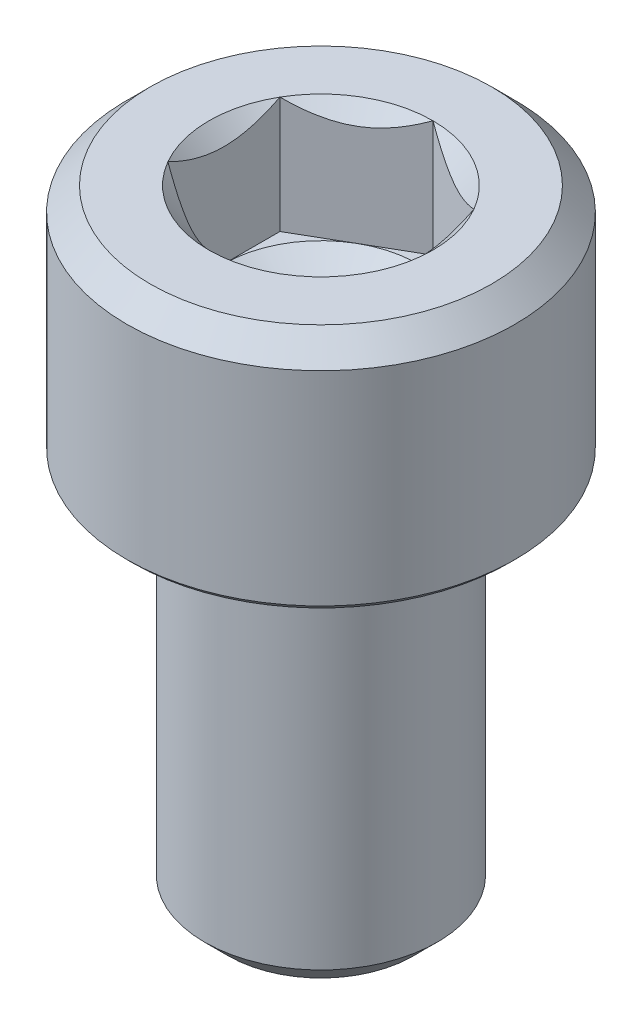
ISO-10303-21;
HEADER;
FILE_DESCRIPTION(('STEP AP214'),'2;1');
FILE_NAME('part.step','',(''),(''),'','','');
FILE_SCHEMA(('AUTOMOTIVE_DESIGN { 1 0 10303 214 1 1 1 1 }'));
ENDSEC;
DATA;
#1=APPLICATION_CONTEXT('core data for automotive mechanical design processes');
#2=APPLICATION_PROTOCOL_DEFINITION('international standard','automotive_design',2000,#1);
#3=PRODUCT_CONTEXT('',#1,'mechanical');
#4=PRODUCT('Part','Part','',(#3));
#5=PRODUCT_RELATED_PRODUCT_CATEGORY('part','',(#4));
#6=PRODUCT_DEFINITION_FORMATION('','',#4);
#7=PRODUCT_DEFINITION_CONTEXT('part definition',#1,'design');
#8=PRODUCT_DEFINITION('design','',#6,#7);
#9=PRODUCT_DEFINITION_SHAPE('','',#8);
#10=(LENGTH_UNIT() NAMED_UNIT(*) SI_UNIT(.MILLI.,.METRE.));
#11=(NAMED_UNIT(*) PLANE_ANGLE_UNIT() SI_UNIT($,.RADIAN.));
#12=(NAMED_UNIT(*) SI_UNIT($,.STERADIAN.) SOLID_ANGLE_UNIT());
#13=UNCERTAINTY_MEASURE_WITH_UNIT(LENGTH_MEASURE(1.E-05),#10,'distance_accuracy_value','');
#14=(GEOMETRIC_REPRESENTATION_CONTEXT(3) GLOBAL_UNCERTAINTY_ASSIGNED_CONTEXT((#13)) GLOBAL_UNIT_ASSIGNED_CONTEXT((#10,
#11,#12)) REPRESENTATION_CONTEXT('',''));
#15=CARTESIAN_POINT('',(0.,0.,0.));
#16=DIRECTION('',(0.,0.,1.));
#17=DIRECTION('',(1.,0.,0.));
#18=AXIS2_PLACEMENT_3D('',#15,#16,#17);
#19=CARTESIAN_POINT('',(0.,6.,0.));
#20=DIRECTION('',(0.,1.,0.));
#21=DIRECTION('',(0.,0.,1.));
#22=AXIS2_PLACEMENT_3D('',#19,#20,#21);
#23=CONICAL_SURFACE('',#22,2.8867513459481,0.785398163397449);
#24=CARTESIAN_POINT('',(0.,6.,0.));
#25=DIRECTION('',(0.,1.,0.));
#26=DIRECTION('',(0.,0.,1.));
#27=AXIS2_PLACEMENT_3D('',#24,#25,#26);
#28=CIRCLE('',#27,2.8867513459481);
#29=CARTESIAN_POINT('',(-2.5,6.,-1.4433756729741));
#30=VERTEX_POINT('',#29);
#31=CARTESIAN_POINT('',(-2.49999999999992,6.,1.44337567297415));
#32=VERTEX_POINT('',#31);
#33=EDGE_CURVE('E248',#30,#32,#28,.T.);
#34=ORIENTED_EDGE('',*,*,#33,.T.);
#35=CARTESIAN_POINT('',(-2.5,8.13577537813778,4.35611922405216));
#36=CARTESIAN_POINT('',(-2.5,8.02405641725018,4.22725866001411));
#37=CARTESIAN_POINT('',(-2.5,7.91298496215348,4.09782489086442));
#38=CARTESIAN_POINT('',(-2.5,7.69259879452268,3.83736651955328));
#39=CARTESIAN_POINT('',(-2.5,7.58328494304011,3.70634118973727));
#40=CARTESIAN_POINT('',(-2.5,7.36449428724609,3.43934006325917));
#41=CARTESIAN_POINT('',(-2.5,7.25507161834458,3.30331973073166));
#42=CARTESIAN_POINT('',(-2.5,7.03955046037823,3.02871290645587));
#43=CARTESIAN_POINT('',(-2.5,6.93345114490513,2.89012706652308));
#44=CARTESIAN_POINT('',(-2.5,6.72569625037672,2.60935358025565));
#45=CARTESIAN_POINT('',(-2.5,6.6240468245615,2.46716135079698));
#46=CARTESIAN_POINT('',(-2.5,6.42728703234702,2.17809364419258));
#47=CARTESIAN_POINT('',(-2.5,6.33218202887993,2.03121446717302));
#48=CARTESIAN_POINT('',(-2.5,6.15259291190783,1.73256542621068));
#49=CARTESIAN_POINT('',(-2.5,6.06803248336327,1.58084206421607));
#50=CARTESIAN_POINT('',(-2.5,5.91405163519296,1.26990866786594));
#51=CARTESIAN_POINT('',(-2.5,5.84460335921078,1.11071307737));
#52=CARTESIAN_POINT('',(-2.5,5.75713367176379,0.863830735911962));
#53=CARTESIAN_POINT('',(-2.5,5.73056031651566,0.77918822794078));
#54=CARTESIAN_POINT('',(-2.5,5.68477521230842,0.607910212253449));
#55=CARTESIAN_POINT('',(-2.5,5.66556228833098,0.521275024991145));
#56=CARTESIAN_POINT('',(-2.5,5.63577461402971,0.347055167302571));
#57=CARTESIAN_POINT('',(-2.5,5.62514725633831,0.259479663207441));
#58=CARTESIAN_POINT('',(-2.5,5.61311288672129,0.0836918904943487));
#59=CARTESIAN_POINT('',(-2.5,5.61170490624327,-0.00452031025991832));
#60=CARTESIAN_POINT('',(-2.5,5.61822212538,-0.180706628736106));
#61=CARTESIAN_POINT('',(-2.5,5.62615950537358,-0.268680285623321));
#62=CARTESIAN_POINT('',(-2.5,5.65078694752076,-0.4433847172262));
#63=CARTESIAN_POINT('',(-2.5,5.66747873326785,-0.53011524373493));
#64=CARTESIAN_POINT('',(-2.5,5.70866876791724,-0.702320390459004));
#65=CARTESIAN_POINT('',(-2.5,5.73322158395549,-0.787781727344903));
#66=CARTESIAN_POINT('',(-2.5,5.78880674634176,-0.956537282986467));
#67=CARTESIAN_POINT('',(-2.5,5.81983916442736,-1.03983147773758));
#68=CARTESIAN_POINT('',(-2.5,5.89474881513276,-1.22278399037513));
#69=CARTESIAN_POINT('',(-2.5,5.93994460001273,-1.32189786118762));
#70=CARTESIAN_POINT('',(-2.5,6.03636406758989,-1.51717428919826));
#71=CARTESIAN_POINT('',(-2.5,6.08759123298224,-1.61333510041087));
#72=CARTESIAN_POINT('',(-2.5,6.19473393742913,-1.80324961470382));
#73=CARTESIAN_POINT('',(-2.5,6.25065896885276,-1.89699791868208));
#74=CARTESIAN_POINT('',(-2.5,6.36602738775932,-2.0822628264869));
#75=CARTESIAN_POINT('',(-2.5,6.42547007579172,-2.17377986890127));
#76=CARTESIAN_POINT('',(-2.5,6.54742331755098,-2.35544305197522));
#77=CARTESIAN_POINT('',(-2.5,6.60994847288596,-2.44557934493647));
#78=CARTESIAN_POINT('',(-2.5,6.73719466368036,-2.62429215374481));
#79=CARTESIAN_POINT('',(-2.5,6.80191586463728,-2.71286855126818));
#80=CARTESIAN_POINT('',(-2.5,6.99853021283137,-2.97643633428369));
#81=CARTESIAN_POINT('',(-2.5,7.13302426311329,-3.14948514704153));
#82=CARTESIAN_POINT('',(-2.5,7.41100964091672,-3.49742558299302));
#83=CARTESIAN_POINT('',(-2.5,7.554651272507,-3.67219593456774));
#84=CARTESIAN_POINT('',(-2.5,7.77187642571592,-3.93128178305337));
#85=CARTESIAN_POINT('',(-2.5,7.84418027248007,-4.01667541105766));
#86=CARTESIAN_POINT('',(-2.5,7.98948272073259,-4.18683801333489));
#87=CARTESIAN_POINT('',(-2.5,8.06248116930567,-4.27160711812367));
#88=CARTESIAN_POINT('',(-2.5,8.13577537813778,-4.35611922405216));
#89=B_SPLINE_CURVE_WITH_KNOTS('',3,(#35,#36,#37,#38,#39,#40,#41,#42,#43,#44,#45,#46,#47,#48,#49,
#50,#51,#52,#53,#54,#55,#56,#57,#58,#59,#60,#61,#62,#63,#64,#65,#66,#67,#68,#69,#70,#71,#72,#73,
#74,#75,#76,#77,#78,#79,#80,#81,#82,#83,#84,#85,#86,#87,#88),.UNSPECIFIED.,.F.,.F.,(4,2,2,2,2,2,
2,2,2,2,2,2,2,2,2,2,2,2,2,2,2,2,2,2,2,2,4),(0.,0.511651260827456,1.02354597863304,
1.54722019644247,2.07076314295684,2.59500853626768,3.11967853721106,3.64029866615624,
4.15995084602471,4.42583268235065,4.69167205562896,4.95586989463535,5.22003997758482,
5.48455475102643,5.74912162248551,6.0155663133838,6.28201395432689,6.60853329817757,
6.93524211714078,7.26262772981258,7.58994846247603,7.91900556147608,8.24808751406486,
8.9054558787836,9.58407513821354,9.9197492883033,10.2553511756034),.UNSPECIFIED.);
#90=EDGE_CURVE('E135',#32,#30,#89,.T.);
#91=ORIENTED_EDGE('',*,*,#90,.T.);
#92=EDGE_LOOP('',(#34,#91));
#93=FACE_BOUND('',#92,.T.);
#94=ADVANCED_FACE('F43',(#93),#23,.F.);
#95=CARTESIAN_POINT('',(0.,6.,-2.8867513459481));
#96=VERTEX_POINT('',#95);
#97=EDGE_CURVE('E250',#96,#30,#28,.T.);
#98=ORIENTED_EDGE('',*,*,#97,.T.);
#99=CARTESIAN_POINT('',(-2.5002,6.00011547698181,-1.44326020292026));
#100=CARTESIAN_POINT('',(-2.41426172221223,5.95054070535477,-1.49287669073472));
#101=CARTESIAN_POINT('',(-2.32688643272424,5.90387748136255,-1.54332283764113));
#102=CARTESIAN_POINT('',(-2.1487185438344,5.81843814003834,-1.64618811625262));
#103=CARTESIAN_POINT('',(-2.05790899931891,5.77970956240604,-1.69861703122362));
#104=CARTESIAN_POINT('',(-1.87479587687306,5.71336670389778,-1.80433744175989));
#105=CARTESIAN_POINT('',(-1.78253893547064,5.68558566853089,-1.85760201171318));
#106=CARTESIAN_POINT('',(-1.59599399122369,5.6427831759107,-1.96530378549012));
#107=CARTESIAN_POINT('',(-1.50171168743369,5.62772976667138,-2.01973769896309));
#108=CARTESIAN_POINT('',(-1.33922174170812,5.61414772220951,-2.11355131286835));
#109=CARTESIAN_POINT('',(-1.27122403211982,5.61213709924083,-2.15280980880343));
#110=CARTESIAN_POINT('',(-1.13533975883075,5.61552411718752,-2.23126263056551));
#111=CARTESIAN_POINT('',(-1.06745324244773,5.62092435529985,-2.27045692907359));
#112=CARTESIAN_POINT('',(-0.932321211763859,5.6388257884025,-2.34847544336506));
#113=CARTESIAN_POINT('',(-0.865076500246403,5.65133492704651,-2.38729919566124));
#114=CARTESIAN_POINT('',(-0.731749899181763,5.68276750195574,-2.46427534467605));
#115=CARTESIAN_POINT('',(-0.665667920900304,5.70169044649685,-2.50242779262543));
#116=CARTESIAN_POINT('',(-0.496403653308703,5.75786736140827,-2.60015256308362));
#117=CARTESIAN_POINT('',(-0.394270877777082,5.79935583159621,-2.65911894852988));
#118=CARTESIAN_POINT('',(-0.244093585059476,5.8693940467231,-2.74582384890656));
#119=CARTESIAN_POINT('',(-0.194603460117378,5.89400225211609,-2.7743969858641));
#120=CARTESIAN_POINT('',(-0.0965399361611472,5.94546188671524,-2.83101398781791));
#121=CARTESIAN_POINT('',(-0.047965996503069,5.97231193877936,-2.85905816495511));
#122=CARTESIAN_POINT('',(0.00020000000000021,6.00011547698176,-2.88686681600194));
#123=B_SPLINE_CURVE_WITH_KNOTS('',3,(#99,#100,#101,#102,#103,#104,#105,#106,#107,#108,#109,#110,
#111,#112,#113,#114,#115,#116,#117,#118,#119,#120,#121,#122),.UNSPECIFIED.,.F.,.F.,(4,2,2,2,2,2,
2,2,2,2,2,4),(0.,0.33301208513393,0.667964518301409,0.997597032043318,1.32639954393847,
1.56169424147171,1.79707142102085,2.03271213522173,2.26833478775653,2.64260240809533,
2.82922877818862,3.01574133749021),.UNSPECIFIED.);
#124=EDGE_CURVE('E210',#30,#96,#123,.T.);
#125=ORIENTED_EDGE('',*,*,#124,.T.);
#126=EDGE_LOOP('',(#98,#125));
#127=FACE_BOUND('',#126,.T.);
#128=ADVANCED_FACE('F294',(#127),#23,.F.);
#129=CARTESIAN_POINT('',(2.5,6.,-1.4433756729741));
#130=VERTEX_POINT('',#129);
#131=EDGE_CURVE('E247',#130,#96,#28,.T.);
#132=ORIENTED_EDGE('',*,*,#131,.T.);
#133=CARTESIAN_POINT('',(-0.000200000000000023,6.00011547698176,-2.88686681600194));
#134=CARTESIAN_POINT('',(0.085738277787762,5.95054070535473,-2.83725032818748));
#135=CARTESIAN_POINT('',(0.173113567275748,5.90387748136251,-2.78680418128108));
#136=CARTESIAN_POINT('',(0.351281456165578,5.81843814003831,-2.68393890266959));
#137=CARTESIAN_POINT('',(0.442091000681062,5.77970956240602,-2.63150998769859));
#138=CARTESIAN_POINT('',(0.625204123126902,5.71336670389776,-2.52578957716234));
#139=CARTESIAN_POINT('',(0.717461064529319,5.68558566853088,-2.47252500720904));
#140=CARTESIAN_POINT('',(0.904006008776258,5.6427831759107,-2.36482323343211));
#141=CARTESIAN_POINT('',(0.998288312566252,5.62772976667137,-2.31038931995914));
#142=CARTESIAN_POINT('',(1.16077825829181,5.61414772220951,-2.21657570605389));
#143=CARTESIAN_POINT('',(1.22877596788012,5.61213709924083,-2.1773172101188));
#144=CARTESIAN_POINT('',(1.36466024116919,5.61552411718752,-2.09886438835673));
#145=CARTESIAN_POINT('',(1.43254675755221,5.62092435529985,-2.05967008984865));
#146=CARTESIAN_POINT('',(1.56767878823607,5.6388257884025,-1.98165157555718));
#147=CARTESIAN_POINT('',(1.63492349975353,5.65133492704651,-1.942827823261));
#148=CARTESIAN_POINT('',(1.76825010081817,5.68276750195574,-1.86585167424619));
#149=CARTESIAN_POINT('',(1.83433207909963,5.70169044649685,-1.82769922629681));
#150=CARTESIAN_POINT('',(2.00359634669124,5.75786736140828,-1.72997445583861));
#151=CARTESIAN_POINT('',(2.10572912222287,5.79935583159623,-1.67100807039234));
#152=CARTESIAN_POINT('',(2.2559064149405,5.86939404672313,-1.58430317001566));
#153=CARTESIAN_POINT('',(2.3053965398826,5.89400225211612,-1.55573003305811));
#154=CARTESIAN_POINT('',(2.40346006383884,5.94546188671528,-1.49911303110429));
#155=CARTESIAN_POINT('',(2.45203400349693,5.9723119387794,-1.4710688539671));
#156=CARTESIAN_POINT('',(2.5002,6.00011547698181,-1.44326020292026));
#157=B_SPLINE_CURVE_WITH_KNOTS('',3,(#133,#134,#135,#136,#137,#138,#139,#140,#141,#142,#143,
#144,#145,#146,#147,#148,#149,#150,#151,#152,#153,#154,#155,#156),.UNSPECIFIED.,.F.,.F.,(4,2,2,
2,2,2,2,2,2,2,2,4),(0.,0.333012085133908,0.667964518301366,0.997597032043253,1.32639954393838,
1.56169424147162,1.79707142102077,2.03271213522164,2.26833478775644,2.64260240809528,
2.8292287781886,3.01574133749021),.UNSPECIFIED.);
#158=EDGE_CURVE('E261',#96,#130,#157,.T.);
#159=ORIENTED_EDGE('',*,*,#158,.T.);
#160=EDGE_LOOP('',(#132,#159));
#161=FACE_BOUND('',#160,.T.);
#162=ADVANCED_FACE('F259',(#161),#23,.F.);
#163=CARTESIAN_POINT('',(2.5,6.,1.4433756729741));
#164=VERTEX_POINT('',#163);
#165=EDGE_CURVE('E242',#164,#130,#28,.T.);
#166=ORIENTED_EDGE('',*,*,#165,.T.);
#167=CARTESIAN_POINT('',(2.5,8.13577537813778,-4.35611922405216));
#168=CARTESIAN_POINT('',(2.5,8.02405641725018,-4.22725866001411));
#169=CARTESIAN_POINT('',(2.5,7.91298496215348,-4.09782489086442));
#170=CARTESIAN_POINT('',(2.5,7.69259879452268,-3.83736651955328));
#171=CARTESIAN_POINT('',(2.5,7.58328494304011,-3.70634118973727));
#172=CARTESIAN_POINT('',(2.5,7.36449428724609,-3.43934006325917));
#173=CARTESIAN_POINT('',(2.5,7.25507161834458,-3.30331973073166));
#174=CARTESIAN_POINT('',(2.5,7.03955046037823,-3.02871290645587));
#175=CARTESIAN_POINT('',(2.5,6.93345114490513,-2.89012706652308));
#176=CARTESIAN_POINT('',(2.5,6.72569625037672,-2.60935358025565));
#177=CARTESIAN_POINT('',(2.5,6.6240468245615,-2.46716135079698));
#178=CARTESIAN_POINT('',(2.5,6.42728703234702,-2.17809364419258));
#179=CARTESIAN_POINT('',(2.5,6.33218202887993,-2.03121446717302));
#180=CARTESIAN_POINT('',(2.5,6.15259291190783,-1.73256542621068));
#181=CARTESIAN_POINT('',(2.5,6.06803248336327,-1.58084206421607));
#182=CARTESIAN_POINT('',(2.5,5.91405163519296,-1.26990866786594));
#183=CARTESIAN_POINT('',(2.5,5.84460335921078,-1.11071307737));
#184=CARTESIAN_POINT('',(2.5,5.75713367176379,-0.863830735911962));
#185=CARTESIAN_POINT('',(2.5,5.73056031651566,-0.77918822794078));
#186=CARTESIAN_POINT('',(2.5,5.68477521230842,-0.607910212253449));
#187=CARTESIAN_POINT('',(2.5,5.66556228833098,-0.521275024991145));
#188=CARTESIAN_POINT('',(2.5,5.63577461402971,-0.347055167302571));
#189=CARTESIAN_POINT('',(2.5,5.62514725633831,-0.259479663207441));
#190=CARTESIAN_POINT('',(2.5,5.61311288672129,-0.0836918904943487));
#191=CARTESIAN_POINT('',(2.5,5.61170490624327,0.00452031025991832));
#192=CARTESIAN_POINT('',(2.5,5.61822212538,0.180706628736106));
#193=CARTESIAN_POINT('',(2.5,5.62615950537358,0.268680285623321));
#194=CARTESIAN_POINT('',(2.5,5.65078694752076,0.4433847172262));
#195=CARTESIAN_POINT('',(2.5,5.66747873326785,0.53011524373493));
#196=CARTESIAN_POINT('',(2.5,5.70866876791724,0.702320390459004));
#197=CARTESIAN_POINT('',(2.5,5.73322158395549,0.787781727344903));
#198=CARTESIAN_POINT('',(2.5,5.78880674634176,0.956537282986467));
#199=CARTESIAN_POINT('',(2.5,5.81983916442736,1.03983147773758));
#200=CARTESIAN_POINT('',(2.5,5.89474881513276,1.22278399037513));
#201=CARTESIAN_POINT('',(2.5,5.93994460001273,1.32189786118762));
#202=CARTESIAN_POINT('',(2.5,6.03636406758989,1.51717428919826));
#203=CARTESIAN_POINT('',(2.5,6.08759123298224,1.61333510041087));
#204=CARTESIAN_POINT('',(2.5,6.19473393742913,1.80324961470382));
#205=CARTESIAN_POINT('',(2.5,6.25065896885276,1.89699791868208));
#206=CARTESIAN_POINT('',(2.5,6.36602738775932,2.0822628264869));
#207=CARTESIAN_POINT('',(2.5,6.42547007579172,2.17377986890127));
#208=CARTESIAN_POINT('',(2.5,6.54742331755098,2.35544305197522));
#209=CARTESIAN_POINT('',(2.5,6.60994847288596,2.44557934493647));
#210=CARTESIAN_POINT('',(2.5,6.73719466368036,2.62429215374481));
#211=CARTESIAN_POINT('',(2.5,6.80191586463728,2.71286855126818));
#212=CARTESIAN_POINT('',(2.5,6.99853021283137,2.97643633428369));
#213=CARTESIAN_POINT('',(2.5,7.13302426311329,3.14948514704153));
#214=CARTESIAN_POINT('',(2.5,7.41100964091672,3.49742558299302));
#215=CARTESIAN_POINT('',(2.5,7.554651272507,3.67219593456774));
#216=CARTESIAN_POINT('',(2.5,7.77187642571592,3.93128178305337));
#217=CARTESIAN_POINT('',(2.5,7.84418027248007,4.01667541105766));
#218=CARTESIAN_POINT('',(2.5,7.98948272073259,4.18683801333489));
#219=CARTESIAN_POINT('',(2.5,8.06248116930567,4.27160711812367));
#220=CARTESIAN_POINT('',(2.5,8.13577537813778,4.35611922405216));
#221=B_SPLINE_CURVE_WITH_KNOTS('',3,(#167,#168,#169,#170,#171,#172,#173,#174,#175,#176,#177,
#178,#179,#180,#181,#182,#183,#184,#185,#186,#187,#188,#189,#190,#191,#192,#193,#194,#195,#196,
#197,#198,#199,#200,#201,#202,#203,#204,#205,#206,#207,#208,#209,#210,#211,#212,#213,#214,#215,
#216,#217,#218,#219,#220),.UNSPECIFIED.,.F.,.F.,(4,2,2,2,2,2,2,2,2,2,2,2,2,2,2,2,2,2,2,2,2,2,2,
2,2,2,4),(0.,0.511651260827456,1.02354597863304,1.54722019644247,2.07076314295684,
2.59500853626768,3.11967853721106,3.64029866615624,4.15995084602471,4.42583268235065,
4.69167205562896,4.95586989463535,5.22003997758482,5.48455475102643,5.74912162248551,
6.0155663133838,6.28201395432689,6.60853329817757,6.93524211714078,7.26262772981258,
7.58994846247603,7.91900556147608,8.24808751406486,8.9054558787836,9.58407513821354,
9.9197492883033,10.2553511756034),.UNSPECIFIED.);
#222=EDGE_CURVE('E269',#130,#164,#221,.T.);
#223=ORIENTED_EDGE('',*,*,#222,.T.);
#224=EDGE_LOOP('',(#166,#223));
#225=FACE_BOUND('',#224,.T.);
#226=ADVANCED_FACE('F268',(#225),#23,.F.);
#227=CARTESIAN_POINT('',(0.,6.,2.8867513459481));
#228=VERTEX_POINT('',#227);
#229=EDGE_CURVE('E240',#228,#164,#28,.T.);
#230=ORIENTED_EDGE('',*,*,#229,.T.);
#231=CARTESIAN_POINT('',(2.5002,6.00011547698181,1.44326020292026));
#232=CARTESIAN_POINT('',(2.41426172221223,5.95054070535477,1.49287669073472));
#233=CARTESIAN_POINT('',(2.32688643272424,5.90387748136255,1.54332283764113));
#234=CARTESIAN_POINT('',(2.1487185438344,5.81843814003834,1.64618811625262));
#235=CARTESIAN_POINT('',(2.05790899931891,5.77970956240604,1.69861703122362));
#236=CARTESIAN_POINT('',(1.87479587687306,5.71336670389778,1.80433744175989));
#237=CARTESIAN_POINT('',(1.78253893547064,5.68558566853089,1.85760201171318));
#238=CARTESIAN_POINT('',(1.59599399122369,5.6427831759107,1.96530378549012));
#239=CARTESIAN_POINT('',(1.50171168743369,5.62772976667138,2.01973769896309));
#240=CARTESIAN_POINT('',(1.33922174170812,5.61414772220951,2.11355131286835));
#241=CARTESIAN_POINT('',(1.27122403211982,5.61213709924083,2.15280980880343));
#242=CARTESIAN_POINT('',(1.13533975883075,5.61552411718752,2.23126263056551));
#243=CARTESIAN_POINT('',(1.06745324244773,5.62092435529985,2.27045692907359));
#244=CARTESIAN_POINT('',(0.932321211763859,5.6388257884025,2.34847544336506));
#245=CARTESIAN_POINT('',(0.865076500246403,5.65133492704651,2.38729919566124));
#246=CARTESIAN_POINT('',(0.731749899181763,5.68276750195574,2.46427534467605));
#247=CARTESIAN_POINT('',(0.665667920900304,5.70169044649685,2.50242779262543));
#248=CARTESIAN_POINT('',(0.496403653308703,5.75786736140827,2.60015256308362));
#249=CARTESIAN_POINT('',(0.394270877777082,5.79935583159621,2.65911894852988));
#250=CARTESIAN_POINT('',(0.244093585059476,5.8693940467231,2.74582384890656));
#251=CARTESIAN_POINT('',(0.194603460117378,5.89400225211609,2.7743969858641));
#252=CARTESIAN_POINT('',(0.0965399361611472,5.94546188671524,2.83101398781791));
#253=CARTESIAN_POINT('',(0.047965996503069,5.97231193877936,2.85905816495511));
#254=CARTESIAN_POINT('',(-0.00020000000000021,6.00011547698176,2.88686681600194));
#255=B_SPLINE_CURVE_WITH_KNOTS('',3,(#231,#232,#233,#234,#235,#236,#237,#238,#239,#240,#241,
#242,#243,#244,#245,#246,#247,#248,#249,#250,#251,#252,#253,#254),.UNSPECIFIED.,.F.,.F.,(4,2,2,
2,2,2,2,2,2,2,2,4),(0.,0.33301208513393,0.667964518301409,0.997597032043318,1.32639954393847,
1.56169424147171,1.79707142102085,2.03271213522173,2.26833478775653,2.64260240809533,
2.82922877818862,3.01574133749021),.UNSPECIFIED.);
#256=EDGE_CURVE('E179',#164,#228,#255,.T.);
#257=ORIENTED_EDGE('',*,*,#256,.T.);
#258=EDGE_LOOP('',(#230,#257));
#259=FACE_BOUND('',#258,.T.);
#260=ADVANCED_FACE('F299',(#259),#23,.F.);
#261=EDGE_CURVE('E239',#32,#228,#28,.T.);
#262=ORIENTED_EDGE('',*,*,#261,.T.);
#263=CARTESIAN_POINT('',(0.000200000000000023,6.00011547698176,2.88686681600194));
#264=CARTESIAN_POINT('',(-0.085738277787762,5.95054070535473,2.83725032818748));
#265=CARTESIAN_POINT('',(-0.173113567275748,5.90387748136251,2.78680418128108));
#266=CARTESIAN_POINT('',(-0.351281456165578,5.81843814003831,2.68393890266959));
#267=CARTESIAN_POINT('',(-0.442091000681062,5.77970956240602,2.63150998769859));
#268=CARTESIAN_POINT('',(-0.625204123126902,5.71336670389776,2.52578957716234));
#269=CARTESIAN_POINT('',(-0.717461064529319,5.68558566853088,2.47252500720904));
#270=CARTESIAN_POINT('',(-0.904006008776258,5.6427831759107,2.36482323343211));
#271=CARTESIAN_POINT('',(-0.998288312566252,5.62772976667137,2.31038931995914));
#272=CARTESIAN_POINT('',(-1.16077825829181,5.61414772220951,2.21657570605389));
#273=CARTESIAN_POINT('',(-1.22877596788012,5.61213709924083,2.1773172101188));
#274=CARTESIAN_POINT('',(-1.36466024116919,5.61552411718752,2.09886438835673));
#275=CARTESIAN_POINT('',(-1.43254675755221,5.62092435529985,2.05967008984865));
#276=CARTESIAN_POINT('',(-1.56767878823607,5.6388257884025,1.98165157555718));
#277=CARTESIAN_POINT('',(-1.63492349975353,5.65133492704651,1.942827823261));
#278=CARTESIAN_POINT('',(-1.76825010081817,5.68276750195574,1.86585167424619));
#279=CARTESIAN_POINT('',(-1.83433207909963,5.70169044649685,1.82769922629681));
#280=CARTESIAN_POINT('',(-2.00359634669124,5.75786736140828,1.72997445583861));
#281=CARTESIAN_POINT('',(-2.10572912222287,5.79935583159623,1.67100807039234));
#282=CARTESIAN_POINT('',(-2.2559064149405,5.86939404672313,1.58430317001566));
#283=CARTESIAN_POINT('',(-2.3053965398826,5.89400225211612,1.55573003305811));
#284=CARTESIAN_POINT('',(-2.40346006383884,5.94546188671528,1.49911303110429));
#285=CARTESIAN_POINT('',(-2.45203400349693,5.9723119387794,1.4710688539671));
#286=CARTESIAN_POINT('',(-2.5002,6.00011547698181,1.44326020292026));
#287=B_SPLINE_CURVE_WITH_KNOTS('',3,(#263,#264,#265,#266,#267,#268,#269,#270,#271,#272,#273,
#274,#275,#276,#277,#278,#279,#280,#281,#282,#283,#284,#285,#286),.UNSPECIFIED.,.F.,.F.,(4,2,2,
2,2,2,2,2,2,2,2,4),(0.,0.333012085133908,0.667964518301366,0.997597032043253,1.32639954393838,
1.56169424147162,1.79707142102077,2.03271213522164,2.26833478775644,2.64260240809528,
2.8292287781886,3.01574133749021),.UNSPECIFIED.);
#288=EDGE_CURVE('E66',#228,#32,#287,.T.);
#289=ORIENTED_EDGE('',*,*,#288,.T.);
#290=EDGE_LOOP('',(#262,#289));
#291=FACE_BOUND('',#290,.T.);
#292=ADVANCED_FACE('F186',(#291),#23,.F.);
#293=CARTESIAN_POINT('',(2.8867513459481,6.,0.));
#294=DIRECTION('',(0.,-1.,0.));
#295=DIRECTION('',(0.,0.,-1.));
#296=AXIS2_PLACEMENT_3D('',#293,#294,#295);
#297=PLANE('',#296);
#298=ORIENTED_EDGE('',*,*,#229,.F.);
#299=ORIENTED_EDGE('',*,*,#261,.F.);
#300=ORIENTED_EDGE('',*,*,#33,.F.);
#301=ORIENTED_EDGE('',*,*,#97,.F.);
#302=ORIENTED_EDGE('',*,*,#131,.F.);
#303=ORIENTED_EDGE('',*,*,#165,.F.);
#304=EDGE_LOOP('',(#298,#299,#300,#301,#302,#303));
#305=FACE_BOUND('',#304,.T.);
#306=CARTESIAN_POINT('',(0.,6.,0.));
#307=DIRECTION('',(0.,1.,0.));
#308=DIRECTION('',(0.,0.,1.));
#309=AXIS2_PLACEMENT_3D('',#306,#307,#308);
#310=CIRCLE('',#309,4.4);
#311=CARTESIAN_POINT('',(0.,6.,4.4));
#312=VERTEX_POINT('',#311);
#313=EDGE_CURVE('E237',#312,#312,#310,.T.);
#314=ORIENTED_EDGE('',*,*,#313,.T.);
#315=EDGE_LOOP('',(#314));
#316=FACE_BOUND('',#315,.T.);
#317=ADVANCED_FACE('F265',(#305,#316),#297,.F.);
#318=CARTESIAN_POINT('',(0.,5.4,0.));
#319=DIRECTION('',(0.,-1.,0.));
#320=DIRECTION('',(0.,0.,-1.));
#321=AXIS2_PLACEMENT_3D('',#318,#319,#320);
#322=CONICAL_SURFACE('',#321,5.,0.785398163397448);
#323=ORIENTED_EDGE('',*,*,#313,.F.);
#324=EDGE_LOOP('',(#323));
#325=FACE_BOUND('',#324,.T.);
#326=CARTESIAN_POINT('',(0.,5.4,0.));
#327=DIRECTION('',(0.,1.,0.));
#328=DIRECTION('',(0.,0.,1.));
#329=AXIS2_PLACEMENT_3D('',#326,#327,#328);
#330=CIRCLE('',#329,5.);
#331=CARTESIAN_POINT('',(0.,5.4,5.));
#332=VERTEX_POINT('',#331);
#333=EDGE_CURVE('E234',#332,#332,#330,.T.);
#334=ORIENTED_EDGE('',*,*,#333,.T.);
#335=EDGE_LOOP('',(#334));
#336=FACE_BOUND('',#335,.T.);
#337=ADVANCED_FACE('F304',(#325,#336),#322,.T.);
#338=CARTESIAN_POINT('',(0.,-10.,0.));
#339=DIRECTION('',(0.,1.,0.));
#340=DIRECTION('',(0.,0.,1.));
#341=AXIS2_PLACEMENT_3D('',#338,#339,#340);
#342=CYLINDRICAL_SURFACE('',#341,5.);
#343=ORIENTED_EDGE('',*,*,#333,.F.);
#344=EDGE_LOOP('',(#343));
#345=FACE_BOUND('',#344,.T.);
#346=CARTESIAN_POINT('',(0.,0.150000000000001,0.));
#347=DIRECTION('',(0.,1.,0.));
#348=DIRECTION('',(0.,0.,1.));
#349=AXIS2_PLACEMENT_3D('',#346,#347,#348);
#350=CIRCLE('',#349,5.);
#351=CARTESIAN_POINT('',(0.,0.150000000000001,5.));
#352=VERTEX_POINT('',#351);
#353=EDGE_CURVE('E231',#352,#352,#350,.T.);
#354=ORIENTED_EDGE('',*,*,#353,.T.);
#355=EDGE_LOOP('',(#354));
#356=FACE_BOUND('',#355,.T.);
#357=ADVANCED_FACE('F382',(#345,#356),#342,.T.);
#358=CARTESIAN_POINT('',(0.,0.,0.));
#359=DIRECTION('',(0.,1.,0.));
#360=DIRECTION('',(0.,0.,1.));
#361=AXIS2_PLACEMENT_3D('',#358,#359,#360);
#362=CONICAL_SURFACE('',#361,4.85,0.785398163397445);
#363=ORIENTED_EDGE('',*,*,#353,.F.);
#364=EDGE_LOOP('',(#363));
#365=FACE_BOUND('',#364,.T.);
#366=CARTESIAN_POINT('',(0.,0.,0.));
#367=DIRECTION('',(0.,1.,0.));
#368=DIRECTION('',(0.,0.,1.));
#369=AXIS2_PLACEMENT_3D('',#366,#367,#368);
#370=CIRCLE('',#369,4.85);
#371=CARTESIAN_POINT('',(0.,0.,4.85));
#372=VERTEX_POINT('',#371);
#373=EDGE_CURVE('E228',#372,#372,#370,.T.);
#374=ORIENTED_EDGE('',*,*,#373,.T.);
#375=EDGE_LOOP('',(#374));
#376=FACE_BOUND('',#375,.T.);
#377=ADVANCED_FACE('F386',(#365,#376),#362,.T.);
#378=CARTESIAN_POINT('',(4.85,0.,0.));
#379=DIRECTION('',(0.,1.,0.));
#380=DIRECTION('',(0.,0.,1.));
#381=AXIS2_PLACEMENT_3D('',#378,#379,#380);
#382=PLANE('',#381);
#383=ORIENTED_EDGE('',*,*,#373,.F.);
#384=EDGE_LOOP('',(#383));
#385=FACE_BOUND('',#384,.T.);
#386=CARTESIAN_POINT('',(0.,0.,0.));
#387=DIRECTION('',(0.,1.,0.));
#388=DIRECTION('',(0.,0.,1.));
#389=AXIS2_PLACEMENT_3D('',#386,#387,#388);
#390=CIRCLE('',#389,3.05);
#391=CARTESIAN_POINT('',(0.,0.,3.05));
#392=VERTEX_POINT('',#391);
#393=EDGE_CURVE('E225',#392,#392,#390,.T.);
#394=ORIENTED_EDGE('',*,*,#393,.T.);
#395=EDGE_LOOP('',(#394));
#396=FACE_BOUND('',#395,.T.);
#397=ADVANCED_FACE('F442',(#385,#396),#382,.F.);
#398=CARTESIAN_POINT('',(0.,-0.68,0.));
#399=DIRECTION('',(0.,1.,0.));
#400=DIRECTION('',(0.,0.,1.));
#401=AXIS2_PLACEMENT_3D('',#398,#399,#400);
#402=CONICAL_SURFACE('',#401,3.,0.0733973259016112);
#403=ORIENTED_EDGE('',*,*,#393,.F.);
#404=EDGE_LOOP('',(#403));
#405=FACE_BOUND('',#404,.T.);
#406=CARTESIAN_POINT('',(0.,-0.68,0.));
#407=DIRECTION('',(0.,1.,0.));
#408=DIRECTION('',(0.,0.,1.));
#409=AXIS2_PLACEMENT_3D('',#406,#407,#408);
#410=CIRCLE('',#409,3.);
#411=CARTESIAN_POINT('',(0.,-0.68,3.));
#412=VERTEX_POINT('',#411);
#413=EDGE_CURVE('E222',#412,#412,#410,.T.);
#414=ORIENTED_EDGE('',*,*,#413,.T.);
#415=EDGE_LOOP('',(#414));
#416=FACE_BOUND('',#415,.T.);
#417=ADVANCED_FACE('F431',(#405,#416),#402,.T.);
#418=CARTESIAN_POINT('',(0.,-10.,0.));
#419=DIRECTION('',(0.,1.,0.));
#420=DIRECTION('',(0.,0.,1.));
#421=AXIS2_PLACEMENT_3D('',#418,#419,#420);
#422=CYLINDRICAL_SURFACE('',#421,3.);
#423=ORIENTED_EDGE('',*,*,#413,.F.);
#424=EDGE_LOOP('',(#423));
#425=FACE_BOUND('',#424,.T.);
#426=CARTESIAN_POINT('',(0.,-9.3865,0.));
#427=DIRECTION('',(0.,1.,0.));
#428=DIRECTION('',(0.,0.,1.));
#429=AXIS2_PLACEMENT_3D('',#426,#427,#428);
#430=CIRCLE('',#429,3.);
#431=CARTESIAN_POINT('',(0.,-9.3865,3.));
#432=VERTEX_POINT('',#431);
#433=EDGE_CURVE('E219',#432,#432,#430,.T.);
#434=ORIENTED_EDGE('',*,*,#433,.T.);
#435=EDGE_LOOP('',(#434));
#436=FACE_BOUND('',#435,.T.);
#437=ADVANCED_FACE('F325',(#425,#436),#422,.T.);
#438=CARTESIAN_POINT('',(0.,-10.,0.));
#439=DIRECTION('',(0.,1.,0.));
#440=DIRECTION('',(0.,0.,1.));
#441=AXIS2_PLACEMENT_3D('',#438,#439,#440);
#442=CONICAL_SURFACE('',#441,2.3865,0.785398163397449);
#443=ORIENTED_EDGE('',*,*,#433,.F.);
#444=EDGE_LOOP('',(#443));
#445=FACE_BOUND('',#444,.T.);
#446=CARTESIAN_POINT('',(0.,-10.,0.));
#447=DIRECTION('',(0.,1.,0.));
#448=DIRECTION('',(0.,0.,1.));
#449=AXIS2_PLACEMENT_3D('',#446,#447,#448);
#450=CIRCLE('',#449,2.3865);
#451=CARTESIAN_POINT('',(0.,-10.,2.3865));
#452=VERTEX_POINT('',#451);
#453=EDGE_CURVE('E209',#452,#452,#450,.T.);
#454=ORIENTED_EDGE('',*,*,#453,.T.);
#455=EDGE_LOOP('',(#454));
#456=FACE_BOUND('',#455,.T.);
#457=ADVANCED_FACE('F408',(#445,#456),#442,.T.);
#458=CARTESIAN_POINT('',(2.3865,-10.,0.));
#459=DIRECTION('',(0.,1.,0.));
#460=DIRECTION('',(0.,0.,1.));
#461=AXIS2_PLACEMENT_3D('',#458,#459,#460);
#462=PLANE('',#461);
#463=ORIENTED_EDGE('',*,*,#453,.F.);
#464=EDGE_LOOP('',(#463));
#465=FACE_BOUND('',#464,.T.);
#466=ADVANCED_FACE('F200',(#465),#462,.F.);
#467=CARTESIAN_POINT('',(0.,3.,0.));
#468=DIRECTION('',(0.,1.,0.));
#469=DIRECTION('',(0.,0.,1.));
#470=AXIS2_PLACEMENT_3D('',#467,#468,#469);
#471=PLANE('',#470);
#472=CARTESIAN_POINT('',(0.,3.,0.));
#473=DIRECTION('',(0.,1.,0.));
#474=DIRECTION('',(0.,0.,1.));
#475=AXIS2_PLACEMENT_3D('',#472,#473,#474);
#476=CIRCLE('',#475,2.5);
#477=CARTESIAN_POINT('',(-2.5,3.,0.));
#478=VERTEX_POINT('',#477);
#479=CARTESIAN_POINT('',(-1.24999999999996,3.,2.16506350946112));
#480=VERTEX_POINT('',#479);
#481=EDGE_CURVE('E125',#478,#480,#476,.T.);
#482=ORIENTED_EDGE('',*,*,#481,.F.);
#483=DIRECTION('',(0.,0.,1.));
#484=VECTOR('',#483,1.);
#485=CARTESIAN_POINT('',(-2.5,3.,-1.4433756729741));
#486=LINE('',#485,#484);
#487=CARTESIAN_POINT('',(-2.5,3.,1.4433756729741));
#488=VERTEX_POINT('',#487);
#489=EDGE_CURVE('E119',#478,#488,#486,.T.);
#490=ORIENTED_EDGE('',*,*,#489,.T.);
#491=DIRECTION('',(0.866025403784448,0.,0.499999999999983));
#492=VECTOR('',#491,1.);
#493=CARTESIAN_POINT('',(-2.5,3.,1.4433756729741));
#494=LINE('',#493,#492);
#495=EDGE_CURVE('E123',#488,#480,#494,.T.);
#496=ORIENTED_EDGE('',*,*,#495,.T.);
#497=EDGE_LOOP('',(#482,#490,#496));
#498=FACE_BOUND('',#497,.T.);
#499=ADVANCED_FACE('F121',(#498),#471,.T.);
#500=CARTESIAN_POINT('',(-1.24999999999996,3.,-2.16506350946112));
#501=VERTEX_POINT('',#500);
#502=EDGE_CURVE('E532',#501,#478,#476,.T.);
#503=ORIENTED_EDGE('',*,*,#502,.F.);
#504=DIRECTION('',(-0.866025403784448,0.,0.499999999999983));
#505=VECTOR('',#504,1.);
#506=CARTESIAN_POINT('',(0.,3.,-2.8867513459481));
#507=LINE('',#506,#505);
#508=CARTESIAN_POINT('',(-2.5,3.,-1.4433756729741));
#509=VERTEX_POINT('',#508);
#510=EDGE_CURVE('E157',#501,#509,#507,.T.);
#511=ORIENTED_EDGE('',*,*,#510,.T.);
#512=EDGE_CURVE('E129',#509,#478,#486,.T.);
#513=ORIENTED_EDGE('',*,*,#512,.T.);
#514=EDGE_LOOP('',(#503,#511,#513));
#515=FACE_BOUND('',#514,.T.);
#516=ADVANCED_FACE('F292',(#515),#471,.T.);
#517=CARTESIAN_POINT('',(1.24999999999996,3.,-2.16506350946112));
#518=VERTEX_POINT('',#517);
#519=EDGE_CURVE('E531',#518,#501,#476,.T.);
#520=ORIENTED_EDGE('',*,*,#519,.F.);
#521=DIRECTION('',(-0.866025403784448,0.,-0.499999999999983));
#522=VECTOR('',#521,1.);
#523=CARTESIAN_POINT('',(2.5,3.,-1.4433756729741));
#524=LINE('',#523,#522);
#525=CARTESIAN_POINT('',(0.,3.,-2.8867513459481));
#526=VERTEX_POINT('',#525);
#527=EDGE_CURVE('E153',#518,#526,#524,.T.);
#528=ORIENTED_EDGE('',*,*,#527,.T.);
#529=EDGE_CURVE('E139',#526,#501,#507,.T.);
#530=ORIENTED_EDGE('',*,*,#529,.T.);
#531=EDGE_LOOP('',(#520,#528,#530));
#532=FACE_BOUND('',#531,.T.);
#533=ADVANCED_FACE('F476',(#532),#471,.T.);
#534=CARTESIAN_POINT('',(2.5,3.,0.));
#535=VERTEX_POINT('',#534);
#536=EDGE_CURVE('E51',#535,#518,#476,.T.);
#537=ORIENTED_EDGE('',*,*,#536,.F.);
#538=DIRECTION('',(0.,0.,-1.));
#539=VECTOR('',#538,1.);
#540=CARTESIAN_POINT('',(2.5,3.,1.4433756729741));
#541=LINE('',#540,#539);
#542=CARTESIAN_POINT('',(2.5,3.,-1.4433756729741));
#543=VERTEX_POINT('',#542);
#544=EDGE_CURVE('E149',#535,#543,#541,.T.);
#545=ORIENTED_EDGE('',*,*,#544,.T.);
#546=EDGE_CURVE('E154',#543,#518,#524,.T.);
#547=ORIENTED_EDGE('',*,*,#546,.T.);
#548=EDGE_LOOP('',(#537,#545,#547));
#549=FACE_BOUND('',#548,.T.);
#550=ADVANCED_FACE('F290',(#549),#471,.T.);
#551=CARTESIAN_POINT('',(1.24999999999996,3.,2.16506350946112));
#552=VERTEX_POINT('',#551);
#553=EDGE_CURVE('E11',#552,#535,#476,.T.);
#554=ORIENTED_EDGE('',*,*,#553,.F.);
#555=DIRECTION('',(0.866025403784448,0.,-0.499999999999983));
#556=VECTOR('',#555,1.);
#557=CARTESIAN_POINT('',(0.,3.,2.8867513459481));
#558=LINE('',#557,#556);
#559=CARTESIAN_POINT('',(2.5,3.,1.4433756729741));
#560=VERTEX_POINT('',#559);
#561=EDGE_CURVE('E145',#552,#560,#558,.T.);
#562=ORIENTED_EDGE('',*,*,#561,.T.);
#563=EDGE_CURVE('E150',#560,#535,#541,.T.);
#564=ORIENTED_EDGE('',*,*,#563,.T.);
#565=EDGE_LOOP('',(#554,#562,#564));
#566=FACE_BOUND('',#565,.T.);
#567=ADVANCED_FACE('F280',(#566),#471,.T.);
#568=EDGE_CURVE('E52',#480,#552,#476,.T.);
#569=ORIENTED_EDGE('',*,*,#568,.F.);
#570=CARTESIAN_POINT('',(0.,3.,2.8867513459481));
#571=VERTEX_POINT('',#570);
#572=EDGE_CURVE('E144',#480,#571,#494,.T.);
#573=ORIENTED_EDGE('',*,*,#572,.T.);
#574=EDGE_CURVE('E59',#571,#552,#558,.T.);
#575=ORIENTED_EDGE('',*,*,#574,.T.);
#576=EDGE_LOOP('',(#569,#573,#575));
#577=FACE_BOUND('',#576,.T.);
#578=ADVANCED_FACE('F199',(#577),#471,.T.);
#579=CARTESIAN_POINT('',(-2.5,3.,-1.4433756729741));
#580=DIRECTION('',(-1.,0.,0.));
#581=DIRECTION('',(0.,0.,1.));
#582=AXIS2_PLACEMENT_3D('',#579,#580,#581);
#583=PLANE('',#582);
#584=ORIENTED_EDGE('',*,*,#90,.F.);
#585=DIRECTION('',(0.,1.,0.));
#586=VECTOR('',#585,1.);
#587=CARTESIAN_POINT('',(-2.5,3.,1.4433756729741));
#588=LINE('',#587,#586);
#589=EDGE_CURVE('E132',#488,#32,#588,.T.);
#590=ORIENTED_EDGE('',*,*,#589,.F.);
#591=ORIENTED_EDGE('',*,*,#489,.F.);
#592=ORIENTED_EDGE('',*,*,#512,.F.);
#593=DIRECTION('',(0.,1.,0.));
#594=VECTOR('',#593,1.);
#595=CARTESIAN_POINT('',(-2.5,3.,-1.4433756729741));
#596=LINE('',#595,#594);
#597=EDGE_CURVE('E160',#509,#30,#596,.T.);
#598=ORIENTED_EDGE('',*,*,#597,.T.);
#599=EDGE_LOOP('',(#584,#590,#591,#592,#598));
#600=FACE_BOUND('',#599,.T.);
#601=ADVANCED_FACE('F133',(#600),#583,.F.);
#602=CARTESIAN_POINT('',(0.,3.,-2.8867513459481));
#603=DIRECTION('',(-0.499999999999983,0.,-0.866025403784448));
#604=DIRECTION('',(-0.866025403784448,0.,0.499999999999983));
#605=AXIS2_PLACEMENT_3D('',#602,#603,#604);
#606=PLANE('',#605);
#607=ORIENTED_EDGE('',*,*,#124,.F.);
#608=ORIENTED_EDGE('',*,*,#597,.F.);
#609=ORIENTED_EDGE('',*,*,#510,.F.);
#610=ORIENTED_EDGE('',*,*,#529,.F.);
#611=DIRECTION('',(0.,1.,0.));
#612=VECTOR('',#611,1.);
#613=CARTESIAN_POINT('',(0.,3.,-2.8867513459481));
#614=LINE('',#613,#612);
#615=EDGE_CURVE('E162',#526,#96,#614,.T.);
#616=ORIENTED_EDGE('',*,*,#615,.T.);
#617=EDGE_LOOP('',(#607,#608,#609,#610,#616));
#618=FACE_BOUND('',#617,.T.);
#619=ADVANCED_FACE('F198',(#618),#606,.F.);
#620=CARTESIAN_POINT('',(2.5,3.,-1.4433756729741));
#621=DIRECTION('',(0.499999999999983,0.,-0.866025403784448));
#622=DIRECTION('',(-0.866025403784448,0.,-0.499999999999983));
#623=AXIS2_PLACEMENT_3D('',#620,#621,#622);
#624=PLANE('',#623);
#625=ORIENTED_EDGE('',*,*,#158,.F.);
#626=ORIENTED_EDGE('',*,*,#615,.F.);
#627=ORIENTED_EDGE('',*,*,#527,.F.);
#628=ORIENTED_EDGE('',*,*,#546,.F.);
#629=DIRECTION('',(0.,1.,0.));
#630=VECTOR('',#629,1.);
#631=CARTESIAN_POINT('',(2.5,3.,-1.4433756729741));
#632=LINE('',#631,#630);
#633=EDGE_CURVE('E165',#543,#130,#632,.T.);
#634=ORIENTED_EDGE('',*,*,#633,.T.);
#635=EDGE_LOOP('',(#625,#626,#627,#628,#634));
#636=FACE_BOUND('',#635,.T.);
#637=ADVANCED_FACE('F332',(#636),#624,.F.);
#638=CARTESIAN_POINT('',(2.5,3.,1.4433756729741));
#639=DIRECTION('',(1.,0.,0.));
#640=DIRECTION('',(0.,0.,-1.));
#641=AXIS2_PLACEMENT_3D('',#638,#639,#640);
#642=PLANE('',#641);
#643=ORIENTED_EDGE('',*,*,#222,.F.);
#644=ORIENTED_EDGE('',*,*,#633,.F.);
#645=ORIENTED_EDGE('',*,*,#544,.F.);
#646=ORIENTED_EDGE('',*,*,#563,.F.);
#647=DIRECTION('',(0.,1.,0.));
#648=VECTOR('',#647,1.);
#649=CARTESIAN_POINT('',(2.5,3.,1.4433756729741));
#650=LINE('',#649,#648);
#651=EDGE_CURVE('E168',#560,#164,#650,.T.);
#652=ORIENTED_EDGE('',*,*,#651,.T.);
#653=EDGE_LOOP('',(#643,#644,#645,#646,#652));
#654=FACE_BOUND('',#653,.T.);
#655=ADVANCED_FACE('F276',(#654),#642,.F.);
#656=CARTESIAN_POINT('',(0.,3.,2.8867513459481));
#657=DIRECTION('',(0.499999999999983,0.,0.866025403784448));
#658=DIRECTION('',(0.866025403784448,0.,-0.499999999999983));
#659=AXIS2_PLACEMENT_3D('',#656,#657,#658);
#660=PLANE('',#659);
#661=ORIENTED_EDGE('',*,*,#256,.F.);
#662=ORIENTED_EDGE('',*,*,#651,.F.);
#663=ORIENTED_EDGE('',*,*,#561,.F.);
#664=ORIENTED_EDGE('',*,*,#574,.F.);
#665=DIRECTION('',(0.,1.,0.));
#666=VECTOR('',#665,1.);
#667=CARTESIAN_POINT('',(0.,3.,2.8867513459481));
#668=LINE('',#667,#666);
#669=EDGE_CURVE('E138',#571,#228,#668,.T.);
#670=ORIENTED_EDGE('',*,*,#669,.T.);
#671=EDGE_LOOP('',(#661,#662,#663,#664,#670));
#672=FACE_BOUND('',#671,.T.);
#673=ADVANCED_FACE('F192',(#672),#660,.F.);
#674=CARTESIAN_POINT('',(-2.5,3.,1.4433756729741));
#675=DIRECTION('',(-0.499999999999983,0.,0.866025403784448));
#676=DIRECTION('',(0.866025403784448,0.,0.499999999999983));
#677=AXIS2_PLACEMENT_3D('',#674,#675,#676);
#678=PLANE('',#677);
#679=ORIENTED_EDGE('',*,*,#288,.F.);
#680=ORIENTED_EDGE('',*,*,#669,.F.);
#681=ORIENTED_EDGE('',*,*,#572,.F.);
#682=ORIENTED_EDGE('',*,*,#495,.F.);
#683=ORIENTED_EDGE('',*,*,#589,.T.);
#684=EDGE_LOOP('',(#679,#680,#681,#682,#683));
#685=FACE_BOUND('',#684,.T.);
#686=ADVANCED_FACE('F142',(#685),#678,.F.);
#687=CARTESIAN_POINT('',(0.,3.,0.));
#688=DIRECTION('',(0.,1.,0.));
#689=DIRECTION('',(0.,0.,1.));
#690=AXIS2_PLACEMENT_3D('',#687,#688,#689);
#691=CONICAL_SURFACE('',#690,2.5,1.04719755119659);
#692=CARTESIAN_POINT('',(0.,1.5566243270259,0.));
#693=VERTEX_POINT('',#692);
#694=VERTEX_LOOP('',#693);
#695=FACE_BOUND('',#694,.T.);
#696=ORIENTED_EDGE('',*,*,#553,.T.);
#697=ORIENTED_EDGE('',*,*,#536,.T.);
#698=ORIENTED_EDGE('',*,*,#519,.T.);
#699=ORIENTED_EDGE('',*,*,#502,.T.);
#700=ORIENTED_EDGE('',*,*,#481,.T.);
#701=ORIENTED_EDGE('',*,*,#568,.T.);
#702=EDGE_LOOP('',(#696,#697,#698,#699,#700,#701));
#703=FACE_BOUND('',#702,.T.);
#704=ADVANCED_FACE('F45',(#695,#703),#691,.F.);
#705=CLOSED_SHELL('',(#94,#128,#162,#226,#260,#292,#317,#337,#357,#377,#397,#417,#437,#457,#466,
#499,#516,#533,#550,#567,#578,#601,#619,#637,#655,#673,#686,#704));
#706=MANIFOLD_SOLID_BREP('B2',#705);
#707=ADVANCED_BREP_SHAPE_REPRESENTATION('',(#18,#706),#14);
#708=SHAPE_DEFINITION_REPRESENTATION(#9,#707);
ENDSEC;
END-ISO-10303-21;
